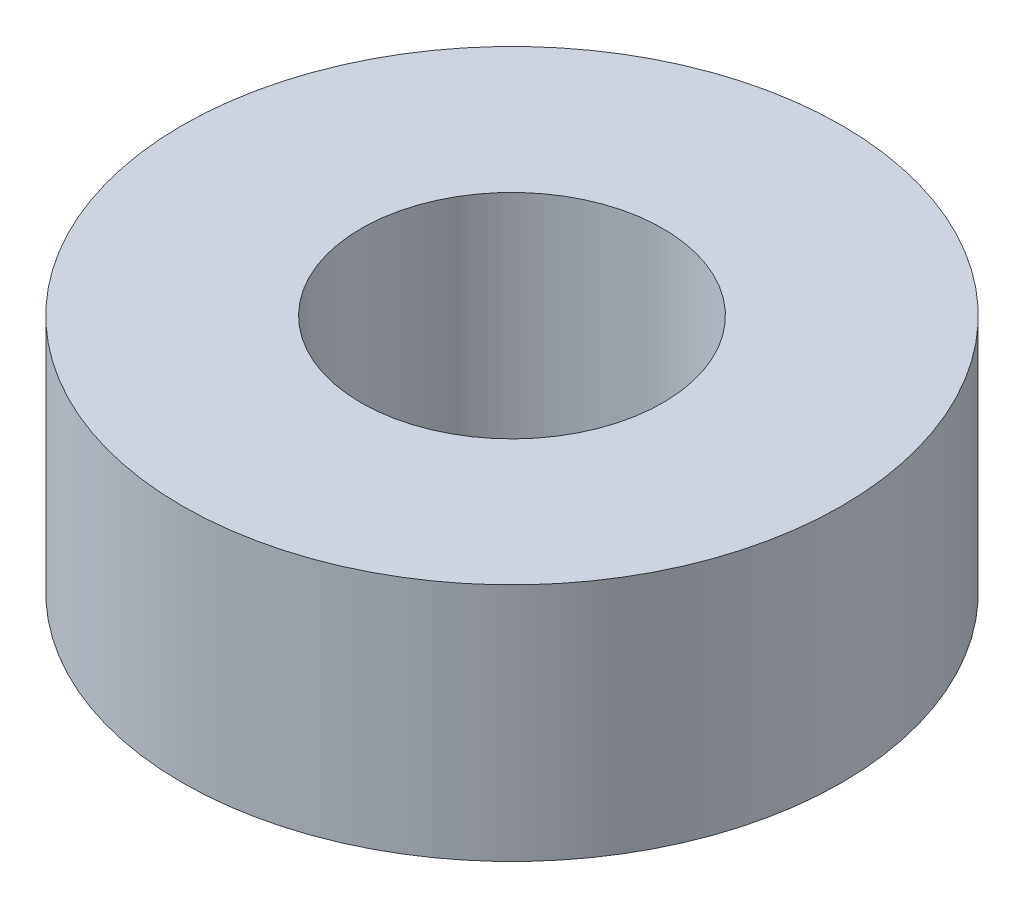
ISO-10303-21;
HEADER;
FILE_DESCRIPTION(('STEP AP214'),'2;1');
FILE_NAME('part.step','',(''),(''),'','','');
FILE_SCHEMA(('AUTOMOTIVE_DESIGN { 1 0 10303 214 1 1 1 1 }'));
ENDSEC;
DATA;
#1=APPLICATION_CONTEXT('core data for automotive mechanical design processes');
#2=APPLICATION_PROTOCOL_DEFINITION('international standard','automotive_design',2000,#1);
#3=PRODUCT_CONTEXT('',#1,'mechanical');
#4=PRODUCT('Part','Part','',(#3));
#5=PRODUCT_RELATED_PRODUCT_CATEGORY('part','',(#4));
#6=PRODUCT_DEFINITION_FORMATION('','',#4);
#7=PRODUCT_DEFINITION_CONTEXT('part definition',#1,'design');
#8=PRODUCT_DEFINITION('design','',#6,#7);
#9=PRODUCT_DEFINITION_SHAPE('','',#8);
#10=(LENGTH_UNIT() NAMED_UNIT(*) SI_UNIT(.MILLI.,.METRE.));
#11=(NAMED_UNIT(*) PLANE_ANGLE_UNIT() SI_UNIT($,.RADIAN.));
#12=(NAMED_UNIT(*) SI_UNIT($,.STERADIAN.) SOLID_ANGLE_UNIT());
#13=UNCERTAINTY_MEASURE_WITH_UNIT(LENGTH_MEASURE(1.E-05),#10,'distance_accuracy_value','');
#14=(GEOMETRIC_REPRESENTATION_CONTEXT(3) GLOBAL_UNCERTAINTY_ASSIGNED_CONTEXT((#13)) GLOBAL_UNIT_ASSIGNED_CONTEXT((#10,
#11,#12)) REPRESENTATION_CONTEXT('',''));
#15=CARTESIAN_POINT('',(0.,0.,0.));
#16=DIRECTION('',(0.,0.,1.));
#17=DIRECTION('',(1.,0.,0.));
#18=AXIS2_PLACEMENT_3D('',#15,#16,#17);
#19=CARTESIAN_POINT('',(0.,6.35,0.));
#20=DIRECTION('',(0.,1.,0.));
#21=DIRECTION('',(0.,0.,1.));
#22=AXIS2_PLACEMENT_3D('',#19,#20,#21);
#23=PLANE('',#22);
#24=CARTESIAN_POINT('',(0.,6.35,0.));
#25=DIRECTION('',(0.,1.,0.));
#26=DIRECTION('',(0.,0.,1.));
#27=AXIS2_PLACEMENT_3D('',#24,#25,#26);
#28=CIRCLE('',#27,8.7376);
#29=CARTESIAN_POINT('',(0.,6.35,8.7376));
#30=VERTEX_POINT('',#29);
#31=EDGE_CURVE('E10',#30,#30,#28,.T.);
#32=ORIENTED_EDGE('',*,*,#31,.T.);
#33=EDGE_LOOP('',(#32));
#34=FACE_BOUND('',#33,.T.);
#35=CARTESIAN_POINT('',(0.,6.35,0.));
#36=DIRECTION('',(0.,1.,0.));
#37=DIRECTION('',(0.,0.,1.));
#38=AXIS2_PLACEMENT_3D('',#35,#36,#37);
#39=CIRCLE('',#38,4.0005);
#40=CARTESIAN_POINT('',(0.,6.35,4.0005));
#41=VERTEX_POINT('',#40);
#42=EDGE_CURVE('E42',#41,#41,#39,.T.);
#43=ORIENTED_EDGE('',*,*,#42,.F.);
#44=EDGE_LOOP('',(#43));
#45=FACE_BOUND('',#44,.T.);
#46=ADVANCED_FACE('F31',(#34,#45),#23,.T.);
#47=CARTESIAN_POINT('',(0.,0.,0.));
#48=DIRECTION('',(0.,1.,0.));
#49=DIRECTION('',(0.,0.,1.));
#50=AXIS2_PLACEMENT_3D('',#47,#48,#49);
#51=PLANE('',#50);
#52=CARTESIAN_POINT('',(0.,0.,0.));
#53=DIRECTION('',(0.,1.,0.));
#54=DIRECTION('',(0.,0.,1.));
#55=AXIS2_PLACEMENT_3D('',#52,#53,#54);
#56=CIRCLE('',#55,8.7376);
#57=CARTESIAN_POINT('',(0.,0.,8.7376));
#58=VERTEX_POINT('',#57);
#59=EDGE_CURVE('E35',#58,#58,#56,.T.);
#60=ORIENTED_EDGE('',*,*,#59,.F.);
#61=EDGE_LOOP('',(#60));
#62=FACE_BOUND('',#61,.T.);
#63=CARTESIAN_POINT('',(0.,0.,0.));
#64=DIRECTION('',(0.,1.,0.));
#65=DIRECTION('',(0.,0.,1.));
#66=AXIS2_PLACEMENT_3D('',#63,#64,#65);
#67=CIRCLE('',#66,4.0005);
#68=CARTESIAN_POINT('',(0.,0.,4.0005));
#69=VERTEX_POINT('',#68);
#70=EDGE_CURVE('E44',#69,#69,#67,.T.);
#71=ORIENTED_EDGE('',*,*,#70,.T.);
#72=EDGE_LOOP('',(#71));
#73=FACE_BOUND('',#72,.T.);
#74=ADVANCED_FACE('F54',(#62,#73),#51,.F.);
#75=CARTESIAN_POINT('',(0.,6.35,0.));
#76=DIRECTION('',(0.,-1.,0.));
#77=DIRECTION('',(0.,0.,-1.));
#78=AXIS2_PLACEMENT_3D('',#75,#76,#77);
#79=CYLINDRICAL_SURFACE('',#78,8.7376);
#80=ORIENTED_EDGE('',*,*,#31,.F.);
#81=EDGE_LOOP('',(#80));
#82=FACE_BOUND('',#81,.T.);
#83=ORIENTED_EDGE('',*,*,#59,.T.);
#84=EDGE_LOOP('',(#83));
#85=FACE_BOUND('',#84,.T.);
#86=ADVANCED_FACE('F33',(#82,#85),#79,.T.);
#87=CARTESIAN_POINT('',(0.,6.35,0.));
#88=DIRECTION('',(0.,-1.,0.));
#89=DIRECTION('',(0.,0.,-1.));
#90=AXIS2_PLACEMENT_3D('',#87,#88,#89);
#91=CYLINDRICAL_SURFACE('',#90,4.0005);
#92=ORIENTED_EDGE('',*,*,#42,.T.);
#93=EDGE_LOOP('',(#92));
#94=FACE_BOUND('',#93,.T.);
#95=ORIENTED_EDGE('',*,*,#70,.F.);
#96=EDGE_LOOP('',(#95));
#97=FACE_BOUND('',#96,.T.);
#98=ADVANCED_FACE('F50',(#94,#97),#91,.F.);
#99=CLOSED_SHELL('',(#46,#74,#86,#98));
#100=MANIFOLD_SOLID_BREP('B2',#99);
#101=ADVANCED_BREP_SHAPE_REPRESENTATION('',(#18,#100),#14);
#102=SHAPE_DEFINITION_REPRESENTATION(#9,#101);
ENDSEC;
END-ISO-10303-21;
